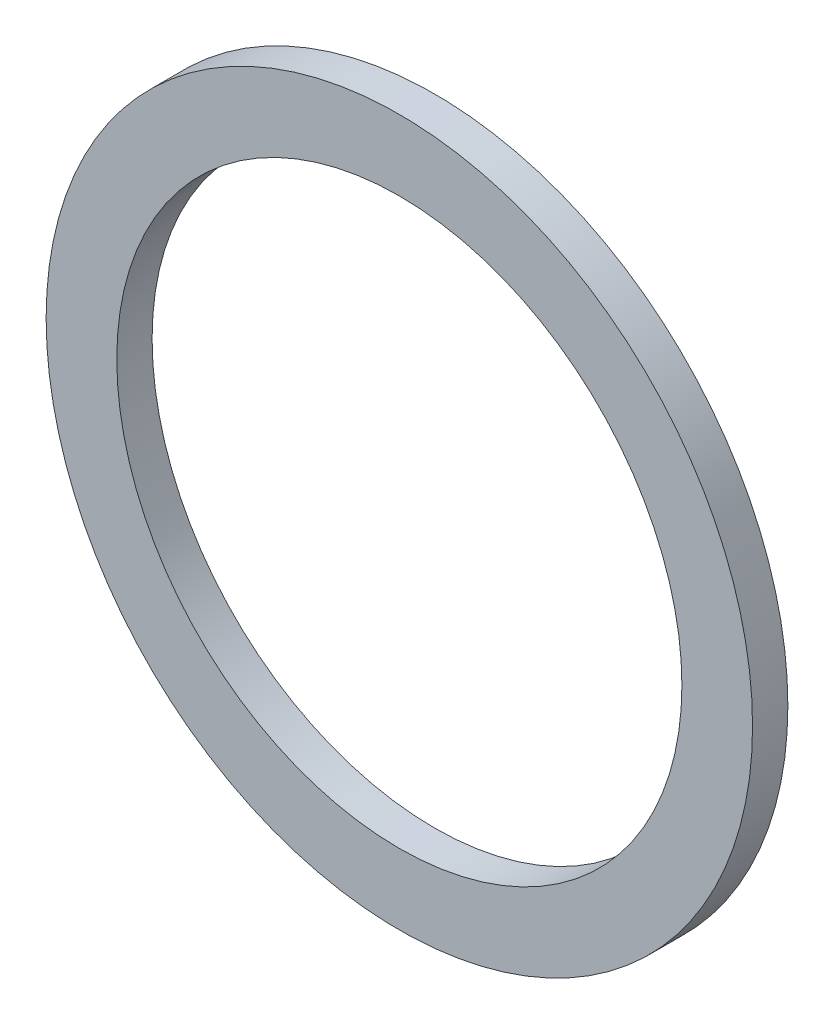
ISO-10303-21;
HEADER;
FILE_DESCRIPTION(('STEP AP214'),'2;1');
FILE_NAME('part.step','',(''),(''),'','','');
FILE_SCHEMA(('AUTOMOTIVE_DESIGN { 1 0 10303 214 1 1 1 1 }'));
ENDSEC;
DATA;
#1=APPLICATION_CONTEXT('core data for automotive mechanical design processes');
#2=APPLICATION_PROTOCOL_DEFINITION('international standard','automotive_design',2000,#1);
#3=PRODUCT_CONTEXT('',#1,'mechanical');
#4=PRODUCT('Part','Part','',(#3));
#5=PRODUCT_RELATED_PRODUCT_CATEGORY('part','',(#4));
#6=PRODUCT_DEFINITION_FORMATION('','',#4);
#7=PRODUCT_DEFINITION_CONTEXT('part definition',#1,'design');
#8=PRODUCT_DEFINITION('design','',#6,#7);
#9=PRODUCT_DEFINITION_SHAPE('','',#8);
#10=(LENGTH_UNIT() NAMED_UNIT(*) SI_UNIT(.MILLI.,.METRE.));
#11=(NAMED_UNIT(*) PLANE_ANGLE_UNIT() SI_UNIT($,.RADIAN.));
#12=(NAMED_UNIT(*) SI_UNIT($,.STERADIAN.) SOLID_ANGLE_UNIT());
#13=UNCERTAINTY_MEASURE_WITH_UNIT(LENGTH_MEASURE(1.E-05),#10,'distance_accuracy_value','');
#14=(GEOMETRIC_REPRESENTATION_CONTEXT(3) GLOBAL_UNCERTAINTY_ASSIGNED_CONTEXT((#13)) GLOBAL_UNIT_ASSIGNED_CONTEXT((#10,
#11,#12)) REPRESENTATION_CONTEXT('',''));
#15=CARTESIAN_POINT('',(0.,0.,0.));
#16=DIRECTION('',(0.,0.,1.));
#17=DIRECTION('',(1.,0.,0.));
#18=AXIS2_PLACEMENT_3D('',#15,#16,#17);
#19=CARTESIAN_POINT('',(-10.5000001639128,5.00000011920929,2.));
#20=DIRECTION('',(0.,0.,1.));
#21=DIRECTION('',(1.,0.,0.));
#22=AXIS2_PLACEMENT_3D('',#19,#20,#21);
#23=PLANE('',#22);
#24=CARTESIAN_POINT('',(-10.5000001639128,5.00000011920929,2.));
#25=DIRECTION('',(0.,0.,-1.));
#26=DIRECTION('',(-1.,0.,0.));
#27=AXIS2_PLACEMENT_3D('',#24,#25,#26);
#28=CIRCLE('',#27,0.8);
#29=CARTESIAN_POINT('',(-9.70000016391277,5.00000011920929,2.));
#30=VERTEX_POINT('',#29);
#31=EDGE_CURVE('E53',#30,#30,#28,.T.);
#32=ORIENTED_EDGE('',*,*,#31,.F.);
#33=EDGE_LOOP('',(#32));
#34=FACE_BOUND('',#33,.T.);
#35=CARTESIAN_POINT('',(-10.5000001639128,5.00000011920929,2.));
#36=DIRECTION('',(0.,0.,1.));
#37=DIRECTION('',(-1.,0.,0.));
#38=AXIS2_PLACEMENT_3D('',#35,#36,#37);
#39=CIRCLE('',#38,1.);
#40=CARTESIAN_POINT('',(-9.50000016391277,5.00000011920929,2.));
#41=VERTEX_POINT('',#40);
#42=EDGE_CURVE('E11',#41,#41,#39,.T.);
#43=ORIENTED_EDGE('',*,*,#42,.F.);
#44=EDGE_LOOP('',(#43));
#45=FACE_BOUND('',#44,.T.);
#46=ADVANCED_FACE('F17',(#34,#45),#23,.F.);
#47=CARTESIAN_POINT('',(-10.5000001639128,5.00000011920929,2.1));
#48=DIRECTION('',(0.,0.,1.));
#49=DIRECTION('',(1.,0.,0.));
#50=AXIS2_PLACEMENT_3D('',#47,#48,#49);
#51=PLANE('',#50);
#52=CARTESIAN_POINT('',(-10.5000001639128,5.00000011920929,2.1));
#53=DIRECTION('',(0.,0.,-1.));
#54=DIRECTION('',(-1.,0.,0.));
#55=AXIS2_PLACEMENT_3D('',#52,#53,#54);
#56=CIRCLE('',#55,0.8);
#57=CARTESIAN_POINT('',(-9.70000016391277,5.00000011920929,2.1));
#58=VERTEX_POINT('',#57);
#59=EDGE_CURVE('E66',#58,#58,#56,.T.);
#60=ORIENTED_EDGE('',*,*,#59,.T.);
#61=EDGE_LOOP('',(#60));
#62=FACE_BOUND('',#61,.T.);
#63=CARTESIAN_POINT('',(-10.5000001639128,5.00000011920929,2.1));
#64=DIRECTION('',(0.,0.,1.));
#65=DIRECTION('',(-1.,0.,0.));
#66=AXIS2_PLACEMENT_3D('',#63,#64,#65);
#67=CIRCLE('',#66,1.);
#68=CARTESIAN_POINT('',(-9.50000016391277,5.00000011920929,2.1));
#69=VERTEX_POINT('',#68);
#70=EDGE_CURVE('E57',#69,#69,#67,.T.);
#71=ORIENTED_EDGE('',*,*,#70,.T.);
#72=EDGE_LOOP('',(#71));
#73=FACE_BOUND('',#72,.T.);
#74=ADVANCED_FACE('F71',(#62,#73),#51,.T.);
#75=CARTESIAN_POINT('',(-10.5000001639128,5.00000011920929,2.));
#76=DIRECTION('',(0.,0.,1.));
#77=DIRECTION('',(-1.,0.,0.));
#78=AXIS2_PLACEMENT_3D('',#75,#76,#77);
#79=CYLINDRICAL_SURFACE('',#78,1.);
#80=ORIENTED_EDGE('',*,*,#70,.F.);
#81=DIRECTION('',(0.,0.,-1.));
#82=VECTOR('',#81,1.);
#83=CARTESIAN_POINT('',(-9.50000016391277,5.00000011920929,2.));
#84=LINE('',#83,#82);
#85=EDGE_CURVE('E27',#69,#41,#84,.T.);
#86=ORIENTED_EDGE('',*,*,#85,.T.);
#87=ORIENTED_EDGE('',*,*,#42,.T.);
#88=ORIENTED_EDGE('',*,*,#85,.F.);
#89=EDGE_LOOP('',(#80,#86,#87,#88));
#90=FACE_BOUND('',#89,.T.);
#91=ADVANCED_FACE('F74',(#90),#79,.T.);
#92=CARTESIAN_POINT('',(-10.5000001639128,5.00000011920929,2.));
#93=DIRECTION('',(0.,0.,1.));
#94=DIRECTION('',(-1.,0.,0.));
#95=AXIS2_PLACEMENT_3D('',#92,#93,#94);
#96=CYLINDRICAL_SURFACE('',#95,0.8);
#97=ORIENTED_EDGE('',*,*,#59,.F.);
#98=DIRECTION('',(0.,0.,-1.));
#99=VECTOR('',#98,1.);
#100=CARTESIAN_POINT('',(-9.70000016391277,5.00000011920929,2.));
#101=LINE('',#100,#99);
#102=EDGE_CURVE('E20',#58,#30,#101,.T.);
#103=ORIENTED_EDGE('',*,*,#102,.T.);
#104=ORIENTED_EDGE('',*,*,#31,.T.);
#105=ORIENTED_EDGE('',*,*,#102,.F.);
#106=EDGE_LOOP('',(#97,#103,#104,#105));
#107=FACE_BOUND('',#106,.T.);
#108=ADVANCED_FACE('F54',(#107),#96,.F.);
#109=CLOSED_SHELL('',(#46,#74,#91,#108));
#110=MANIFOLD_SOLID_BREP('B1',#109);
#111=ADVANCED_BREP_SHAPE_REPRESENTATION('',(#18,#110),#14);
#112=SHAPE_DEFINITION_REPRESENTATION(#9,#111);
ENDSEC;
END-ISO-10303-21;
